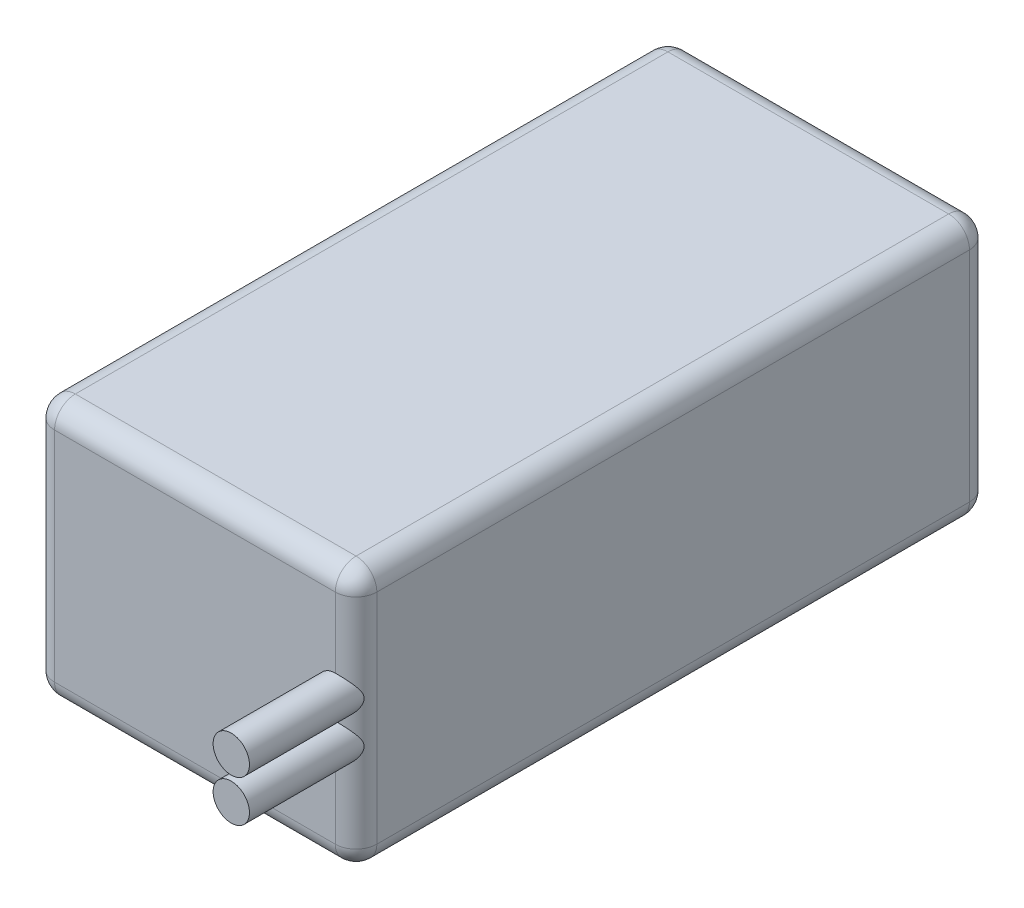
ISO-10303-21;
HEADER;
FILE_DESCRIPTION(('STEP AP214'),'2;1');
FILE_NAME('part.step','',(''),(''),'','','');
FILE_SCHEMA(('AUTOMOTIVE_DESIGN { 1 0 10303 214 1 1 1 1 }'));
ENDSEC;
DATA;
#1=APPLICATION_CONTEXT('core data for automotive mechanical design processes');
#2=APPLICATION_PROTOCOL_DEFINITION('international standard','automotive_design',2000,#1);
#3=PRODUCT_CONTEXT('',#1,'mechanical');
#4=PRODUCT('Part','Part','',(#3));
#5=PRODUCT_RELATED_PRODUCT_CATEGORY('part','',(#4));
#6=PRODUCT_DEFINITION_FORMATION('','',#4);
#7=PRODUCT_DEFINITION_CONTEXT('part definition',#1,'design');
#8=PRODUCT_DEFINITION('design','',#6,#7);
#9=PRODUCT_DEFINITION_SHAPE('','',#8);
#10=(LENGTH_UNIT() NAMED_UNIT(*) SI_UNIT(.MILLI.,.METRE.));
#11=(NAMED_UNIT(*) PLANE_ANGLE_UNIT() SI_UNIT($,.RADIAN.));
#12=(NAMED_UNIT(*) SI_UNIT($,.STERADIAN.) SOLID_ANGLE_UNIT());
#13=UNCERTAINTY_MEASURE_WITH_UNIT(LENGTH_MEASURE(1.E-05),#10,'distance_accuracy_value','');
#14=(GEOMETRIC_REPRESENTATION_CONTEXT(3) GLOBAL_UNCERTAINTY_ASSIGNED_CONTEXT((#13)) GLOBAL_UNIT_ASSIGNED_CONTEXT((#10,
#11,#12)) REPRESENTATION_CONTEXT('',''));
#15=CARTESIAN_POINT('',(0.,0.,0.));
#16=DIRECTION('',(0.,0.,1.));
#17=DIRECTION('',(1.,0.,0.));
#18=AXIS2_PLACEMENT_3D('',#15,#16,#17);
#19=CARTESIAN_POINT('',(15.5,25.,-30.5));
#20=DIRECTION('',(-1.,0.,0.));
#21=DIRECTION('',(0.,0.,1.));
#22=AXIS2_PLACEMENT_3D('',#19,#20,#21);
#23=PLANE('',#22);
#24=DIRECTION('',(0.,-1.,0.));
#25=VECTOR('',#24,1.);
#26=CARTESIAN_POINT('',(15.5,25.,28.5));
#27=LINE('',#26,#25);
#28=CARTESIAN_POINT('',(15.5,23.,28.5));
#29=VERTEX_POINT('',#28);
#30=CARTESIAN_POINT('',(15.5,2.,28.5));
#31=VERTEX_POINT('',#30);
#32=EDGE_CURVE('E327',#29,#31,#27,.T.);
#33=ORIENTED_EDGE('',*,*,#32,.T.);
#34=DIRECTION('',(0.,0.,-1.));
#35=VECTOR('',#34,1.);
#36=CARTESIAN_POINT('',(15.5,2.,-30.5));
#37=LINE('',#36,#35);
#38=CARTESIAN_POINT('',(15.5,2.,-28.5));
#39=VERTEX_POINT('',#38);
#40=EDGE_CURVE('E331',#31,#39,#37,.T.);
#41=ORIENTED_EDGE('',*,*,#40,.T.);
#42=DIRECTION('',(0.,-1.,0.));
#43=VECTOR('',#42,1.);
#44=CARTESIAN_POINT('',(15.5,25.,-28.5));
#45=LINE('',#44,#43);
#46=CARTESIAN_POINT('',(15.5,23.,-28.5));
#47=VERTEX_POINT('',#46);
#48=EDGE_CURVE('E324',#39,#47,#45,.F.);
#49=ORIENTED_EDGE('',*,*,#48,.T.);
#50=DIRECTION('',(0.,0.,-1.));
#51=VECTOR('',#50,1.);
#52=CARTESIAN_POINT('',(15.5,23.,30.5));
#53=LINE('',#52,#51);
#54=EDGE_CURVE('E321',#47,#29,#53,.F.);
#55=ORIENTED_EDGE('',*,*,#54,.T.);
#56=EDGE_LOOP('',(#33,#41,#49,#55));
#57=FACE_BOUND('',#56,.T.);
#58=ADVANCED_FACE('F45',(#57),#23,.F.);
#59=CARTESIAN_POINT('',(-15.5,25.,-30.5));
#60=DIRECTION('',(0.,0.,1.));
#61=DIRECTION('',(1.,0.,0.));
#62=AXIS2_PLACEMENT_3D('',#59,#60,#61);
#63=PLANE('',#62);
#64=DIRECTION('',(0.,-1.,0.));
#65=VECTOR('',#64,1.);
#66=CARTESIAN_POINT('',(13.5,25.,-30.5));
#67=LINE('',#66,#65);
#68=CARTESIAN_POINT('',(13.5,23.,-30.5));
#69=VERTEX_POINT('',#68);
#70=CARTESIAN_POINT('',(13.5,2.,-30.5));
#71=VERTEX_POINT('',#70);
#72=EDGE_CURVE('E161',#69,#71,#67,.T.);
#73=ORIENTED_EDGE('',*,*,#72,.T.);
#74=DIRECTION('',(-1.,0.,0.));
#75=VECTOR('',#74,1.);
#76=CARTESIAN_POINT('',(-15.5,2.,-30.5));
#77=LINE('',#76,#75);
#78=CARTESIAN_POINT('',(-13.5,2.,-30.5));
#79=VERTEX_POINT('',#78);
#80=EDGE_CURVE('E156',#71,#79,#77,.T.);
#81=ORIENTED_EDGE('',*,*,#80,.T.);
#82=DIRECTION('',(0.,-1.,0.));
#83=VECTOR('',#82,1.);
#84=CARTESIAN_POINT('',(-13.5,25.,-30.5));
#85=LINE('',#84,#83);
#86=CARTESIAN_POINT('',(-13.5,23.,-30.5));
#87=VERTEX_POINT('',#86);
#88=EDGE_CURVE('E150',#79,#87,#85,.F.);
#89=ORIENTED_EDGE('',*,*,#88,.T.);
#90=DIRECTION('',(-1.,0.,0.));
#91=VECTOR('',#90,1.);
#92=CARTESIAN_POINT('',(15.5,23.,-30.5));
#93=LINE('',#92,#91);
#94=EDGE_CURVE('E153',#87,#69,#93,.F.);
#95=ORIENTED_EDGE('',*,*,#94,.T.);
#96=EDGE_LOOP('',(#73,#81,#89,#95));
#97=FACE_BOUND('',#96,.T.);
#98=ADVANCED_FACE('F152',(#97),#63,.F.);
#99=CARTESIAN_POINT('',(-15.5,25.,-30.5));
#100=DIRECTION('',(1.,0.,0.));
#101=DIRECTION('',(0.,0.,-1.));
#102=AXIS2_PLACEMENT_3D('',#99,#100,#101);
#103=PLANE('',#102);
#104=DIRECTION('',(0.,-1.,0.));
#105=VECTOR('',#104,1.);
#106=CARTESIAN_POINT('',(-15.5,25.,-28.5));
#107=LINE('',#106,#105);
#108=CARTESIAN_POINT('',(-15.5,23.,-28.5));
#109=VERTEX_POINT('',#108);
#110=CARTESIAN_POINT('',(-15.5,2.,-28.5));
#111=VERTEX_POINT('',#110);
#112=EDGE_CURVE('E186',#109,#111,#107,.T.);
#113=ORIENTED_EDGE('',*,*,#112,.T.);
#114=DIRECTION('',(0.,0.,1.));
#115=VECTOR('',#114,1.);
#116=CARTESIAN_POINT('',(-15.5,2.,-30.5));
#117=LINE('',#116,#115);
#118=CARTESIAN_POINT('',(-15.5,2.,28.5));
#119=VERTEX_POINT('',#118);
#120=EDGE_CURVE('E318',#111,#119,#117,.T.);
#121=ORIENTED_EDGE('',*,*,#120,.T.);
#122=DIRECTION('',(0.,-1.,0.));
#123=VECTOR('',#122,1.);
#124=CARTESIAN_POINT('',(-15.5,25.,28.5));
#125=LINE('',#124,#123);
#126=CARTESIAN_POINT('',(-15.5,23.,28.5));
#127=VERTEX_POINT('',#126);
#128=EDGE_CURVE('E313',#119,#127,#125,.F.);
#129=ORIENTED_EDGE('',*,*,#128,.T.);
#130=DIRECTION('',(0.,0.,1.));
#131=VECTOR('',#130,1.);
#132=CARTESIAN_POINT('',(-15.5,23.,-30.5));
#133=LINE('',#132,#131);
#134=EDGE_CURVE('E310',#127,#109,#133,.F.);
#135=ORIENTED_EDGE('',*,*,#134,.T.);
#136=EDGE_LOOP('',(#113,#121,#129,#135));
#137=FACE_BOUND('',#136,.T.);
#138=ADVANCED_FACE('F386',(#137),#103,.F.);
#139=CARTESIAN_POINT('',(-15.5,25.,30.5));
#140=DIRECTION('',(0.,0.,-1.));
#141=DIRECTION('',(-1.,0.,0.));
#142=AXIS2_PLACEMENT_3D('',#139,#140,#141);
#143=PLANE('',#142);
#144=CARTESIAN_POINT('',(13.5,10.5,30.5));
#145=DIRECTION('',(0.,0.,1.));
#146=DIRECTION('',(1.,0.,0.));
#147=AXIS2_PLACEMENT_3D('',#144,#145,#146);
#148=CIRCLE('',#147,1.75);
#149=CARTESIAN_POINT('',(13.5,8.75,30.5));
#150=VERTEX_POINT('',#149);
#151=CARTESIAN_POINT('',(13.5,12.25,30.5));
#152=VERTEX_POINT('',#151);
#153=EDGE_CURVE('E251',#150,#152,#148,.F.);
#154=ORIENTED_EDGE('',*,*,#153,.T.);
#155=DIRECTION('',(0.,-1.,0.));
#156=VECTOR('',#155,1.);
#157=CARTESIAN_POINT('',(13.5,25.,30.5));
#158=LINE('',#157,#156);
#159=CARTESIAN_POINT('',(13.5,12.75,30.5));
#160=VERTEX_POINT('',#159);
#161=EDGE_CURVE('E307',#152,#160,#158,.F.);
#162=ORIENTED_EDGE('',*,*,#161,.T.);
#163=CARTESIAN_POINT('',(13.5,14.5,30.5));
#164=DIRECTION('',(0.,0.,-1.));
#165=DIRECTION('',(-1.,0.,0.));
#166=AXIS2_PLACEMENT_3D('',#163,#164,#165);
#167=CIRCLE('',#166,1.75);
#168=CARTESIAN_POINT('',(13.5,16.25,30.5));
#169=VERTEX_POINT('',#168);
#170=EDGE_CURVE('E173',#169,#160,#167,.F.);
#171=ORIENTED_EDGE('',*,*,#170,.F.);
#172=DIRECTION('',(0.,-1.,0.));
#173=VECTOR('',#172,1.);
#174=CARTESIAN_POINT('',(13.5,25.,30.5));
#175=LINE('',#174,#173);
#176=CARTESIAN_POINT('',(13.5,23.,30.5));
#177=VERTEX_POINT('',#176);
#178=EDGE_CURVE('E294',#169,#177,#175,.F.);
#179=ORIENTED_EDGE('',*,*,#178,.T.);
#180=DIRECTION('',(1.,0.,0.));
#181=VECTOR('',#180,1.);
#182=CARTESIAN_POINT('',(-15.5,23.,30.5));
#183=LINE('',#182,#181);
#184=CARTESIAN_POINT('',(-13.5,23.,30.5));
#185=VERTEX_POINT('',#184);
#186=EDGE_CURVE('E291',#177,#185,#183,.F.);
#187=ORIENTED_EDGE('',*,*,#186,.T.);
#188=DIRECTION('',(0.,-1.,0.));
#189=VECTOR('',#188,1.);
#190=CARTESIAN_POINT('',(-13.5,25.,30.5));
#191=LINE('',#190,#189);
#192=CARTESIAN_POINT('',(-13.5,2.,30.5));
#193=VERTEX_POINT('',#192);
#194=EDGE_CURVE('E297',#185,#193,#191,.T.);
#195=ORIENTED_EDGE('',*,*,#194,.T.);
#196=DIRECTION('',(1.,0.,0.));
#197=VECTOR('',#196,1.);
#198=CARTESIAN_POINT('',(-15.5,2.,30.5));
#199=LINE('',#198,#197);
#200=CARTESIAN_POINT('',(13.5,2.,30.5));
#201=VERTEX_POINT('',#200);
#202=EDGE_CURVE('E300',#193,#201,#199,.T.);
#203=ORIENTED_EDGE('',*,*,#202,.T.);
#204=DIRECTION('',(0.,-1.,0.));
#205=VECTOR('',#204,1.);
#206=CARTESIAN_POINT('',(13.5,25.,30.5));
#207=LINE('',#206,#205);
#208=EDGE_CURVE('E304',#201,#150,#207,.F.);
#209=ORIENTED_EDGE('',*,*,#208,.T.);
#210=EDGE_LOOP('',(#154,#162,#171,#179,#187,#195,#203,#209));
#211=FACE_BOUND('',#210,.T.);
#212=ADVANCED_FACE('F380',(#211),#143,.F.);
#213=CARTESIAN_POINT('',(0.,25.,0.));
#214=DIRECTION('',(0.,1.,0.));
#215=DIRECTION('',(0.,0.,1.));
#216=AXIS2_PLACEMENT_3D('',#213,#214,#215);
#217=PLANE('',#216);
#218=DIRECTION('',(0.,0.,1.));
#219=VECTOR('',#218,1.);
#220=CARTESIAN_POINT('',(-13.5,25.,30.5));
#221=LINE('',#220,#219);
#222=CARTESIAN_POINT('',(-13.5,25.,-28.5));
#223=VERTEX_POINT('',#222);
#224=CARTESIAN_POINT('',(-13.5,25.,28.5));
#225=VERTEX_POINT('',#224);
#226=EDGE_CURVE('E63',#223,#225,#221,.T.);
#227=ORIENTED_EDGE('',*,*,#226,.T.);
#228=DIRECTION('',(1.,0.,0.));
#229=VECTOR('',#228,1.);
#230=CARTESIAN_POINT('',(15.5,25.,28.5));
#231=LINE('',#230,#229);
#232=CARTESIAN_POINT('',(13.5,25.,28.5));
#233=VERTEX_POINT('',#232);
#234=EDGE_CURVE('E341',#225,#233,#231,.T.);
#235=ORIENTED_EDGE('',*,*,#234,.T.);
#236=DIRECTION('',(0.,0.,-1.));
#237=VECTOR('',#236,1.);
#238=CARTESIAN_POINT('',(13.5,25.,-30.5));
#239=LINE('',#238,#237);
#240=CARTESIAN_POINT('',(13.5,25.,-28.5));
#241=VERTEX_POINT('',#240);
#242=EDGE_CURVE('E334',#233,#241,#239,.T.);
#243=ORIENTED_EDGE('',*,*,#242,.T.);
#244=DIRECTION('',(-1.,0.,0.));
#245=VECTOR('',#244,1.);
#246=CARTESIAN_POINT('',(-15.5,25.,-28.5));
#247=LINE('',#246,#245);
#248=EDGE_CURVE('E68',#241,#223,#247,.T.);
#249=ORIENTED_EDGE('',*,*,#248,.T.);
#250=EDGE_LOOP('',(#227,#235,#243,#249));
#251=FACE_BOUND('',#250,.T.);
#252=ADVANCED_FACE('F377',(#251),#217,.T.);
#253=CARTESIAN_POINT('',(0.,0.,0.));
#254=DIRECTION('',(0.,1.,0.));
#255=DIRECTION('',(0.,0.,1.));
#256=AXIS2_PLACEMENT_3D('',#253,#254,#255);
#257=PLANE('',#256);
#258=DIRECTION('',(1.,0.,0.));
#259=VECTOR('',#258,1.);
#260=CARTESIAN_POINT('',(0.,0.,28.5));
#261=LINE('',#260,#259);
#262=CARTESIAN_POINT('',(13.5,0.,28.5));
#263=VERTEX_POINT('',#262);
#264=CARTESIAN_POINT('',(-13.5,0.,28.5));
#265=VERTEX_POINT('',#264);
#266=EDGE_CURVE('E281',#263,#265,#261,.F.);
#267=ORIENTED_EDGE('',*,*,#266,.T.);
#268=DIRECTION('',(0.,0.,1.));
#269=VECTOR('',#268,1.);
#270=CARTESIAN_POINT('',(-13.5,0.,0.));
#271=LINE('',#270,#269);
#272=CARTESIAN_POINT('',(-13.5,0.,-28.5));
#273=VERTEX_POINT('',#272);
#274=EDGE_CURVE('E288',#265,#273,#271,.F.);
#275=ORIENTED_EDGE('',*,*,#274,.T.);
#276=DIRECTION('',(-1.,0.,0.));
#277=VECTOR('',#276,1.);
#278=CARTESIAN_POINT('',(0.,0.,-28.5));
#279=LINE('',#278,#277);
#280=CARTESIAN_POINT('',(13.5,0.,-28.5));
#281=VERTEX_POINT('',#280);
#282=EDGE_CURVE('E284',#273,#281,#279,.F.);
#283=ORIENTED_EDGE('',*,*,#282,.T.);
#284=DIRECTION('',(0.,0.,-1.));
#285=VECTOR('',#284,1.);
#286=CARTESIAN_POINT('',(13.5,0.,0.));
#287=LINE('',#286,#285);
#288=EDGE_CURVE('E278',#281,#263,#287,.F.);
#289=ORIENTED_EDGE('',*,*,#288,.T.);
#290=EDGE_LOOP('',(#267,#275,#283,#289));
#291=FACE_BOUND('',#290,.T.);
#292=ADVANCED_FACE('F375',(#291),#257,.F.);
#293=CARTESIAN_POINT('',(13.5,14.5,40.5));
#294=DIRECTION('',(0.,0.,-1.));
#295=DIRECTION('',(-1.,0.,0.));
#296=AXIS2_PLACEMENT_3D('',#293,#294,#295);
#297=CYLINDRICAL_SURFACE('',#296,1.75);
#298=CARTESIAN_POINT('',(13.5,14.5,40.5));
#299=DIRECTION('',(0.,0.,1.));
#300=DIRECTION('',(1.,0.,0.));
#301=AXIS2_PLACEMENT_3D('',#298,#299,#300);
#302=CIRCLE('',#301,1.75);
#303=CARTESIAN_POINT('',(15.25,14.5,40.5));
#304=VERTEX_POINT('',#303);
#305=EDGE_CURVE('E265',#304,#304,#302,.T.);
#306=ORIENTED_EDGE('',*,*,#305,.F.);
#307=EDGE_LOOP('',(#306));
#308=FACE_BOUND('',#307,.T.);
#309=ORIENTED_EDGE('',*,*,#170,.T.);
#310=CARTESIAN_POINT('',(13.5,12.75,30.5));
#311=CARTESIAN_POINT('',(13.5411522397854,12.7499904077708,30.500009930612));
#312=CARTESIAN_POINT('',(13.5822970630514,12.751451245837,30.4987301955107));
#313=CARTESIAN_POINT('',(13.6642003605769,12.7572396824727,30.4936674595874));
#314=CARTESIAN_POINT('',(13.7049590943024,12.7615651931795,30.489886281897));
#315=CARTESIAN_POINT('',(13.785458186531,12.7729635595765,30.4799362530637));
#316=CARTESIAN_POINT('',(13.8252040665578,12.7800142891205,30.4737866327881));
#317=CARTESIAN_POINT('',(13.9037148501048,12.7967303576247,30.4592372946331));
#318=CARTESIAN_POINT('',(13.9424796232703,12.8063960420473,30.4508372794548));
#319=CARTESIAN_POINT('',(14.0567092669147,12.8390308068149,30.4225500376096));
#320=CARTESIAN_POINT('',(14.1303963455098,12.8656797563127,30.3995384525789));
#321=CARTESIAN_POINT('',(14.2715913543767,12.9273854763322,30.3467170927728));
#322=CARTESIAN_POINT('',(14.3390863867417,12.9624592697037,30.3168935601603));
#323=CARTESIAN_POINT('',(14.491943648234,13.0545623368453,30.2395214356715));
#324=CARTESIAN_POINT('',(14.5741410463489,13.1148398108444,30.1895753444384));
#325=CARTESIAN_POINT('',(14.7249740673605,13.2462077646548,30.0836600395031));
#326=CARTESIAN_POINT('',(14.793576257381,13.3173241584072,30.0276764876888));
#327=CARTESIAN_POINT('',(14.918728383228,13.4705707905191,29.9122903299628));
#328=CARTESIAN_POINT('',(14.9749819732812,13.5529078610557,29.8528397292722));
#329=CARTESIAN_POINT('',(15.0487625304943,13.6837127938166,29.7660128456874));
#330=CARTESIAN_POINT('',(15.0715794658976,13.7285035129325,29.7374775796423));
#331=CARTESIAN_POINT('',(15.113600352381,13.8207623530626,29.6821565965155));
#332=CARTESIAN_POINT('',(15.1328070510107,13.8682284019771,29.6553695591731));
#333=CARTESIAN_POINT('',(15.1679058744409,13.9675995033164,29.6041204151578));
#334=CARTESIAN_POINT('',(15.1836824610489,14.019594580482,29.5797511222683));
#335=CARTESIAN_POINT('',(15.210663530163,14.1269329049439,29.5364755398292));
#336=CARTESIAN_POINT('',(15.2218767843756,14.1822694916299,29.5175587899443));
#337=CARTESIAN_POINT('',(15.237692467212,14.2872011662924,29.4902722680777));
#338=CARTESIAN_POINT('',(15.243048295828,14.3363635336648,29.4807249979585));
#339=CARTESIAN_POINT('',(15.2495292388131,14.4358159376579,29.4691217005586));
#340=CARTESIAN_POINT('',(15.2506610315262,14.4861040676441,29.4670538482243));
#341=CARTESIAN_POINT('',(15.2485903575146,14.5862818194157,29.4707902414696));
#342=CARTESIAN_POINT('',(15.245387614776,14.6361714156198,29.4765949883591));
#343=CARTESIAN_POINT('',(15.2349536407351,14.7342672228474,29.4950096195382));
#344=CARTESIAN_POINT('',(15.2277143465895,14.7824698587834,29.5076331224265));
#345=CARTESIAN_POINT('',(15.2042505591075,14.9048866504777,29.5470485417914));
#346=CARTESIAN_POINT('',(15.1852402420775,14.9772561736244,29.5777939046892));
#347=CARTESIAN_POINT('',(15.1395636190221,15.1162151497358,29.6460944398059));
#348=CARTESIAN_POINT('',(15.112865343058,15.1827789218411,29.6836778020766));
#349=CARTESIAN_POINT('',(15.0583995753075,15.298192980149,29.7541835766998));
#350=CARTESIAN_POINT('',(15.0318655693204,15.3479592452243,29.7865772355753));
#351=CARTESIAN_POINT('',(14.974378715549,15.4443842784062,29.8520768369737));
#352=CARTESIAN_POINT('',(14.9434233904729,15.4910412827353,29.8851831699204));
#353=CARTESIAN_POINT('',(14.8440064955768,15.6263544232357,29.9840291241305));
#354=CARTESIAN_POINT('',(14.7688910093535,15.7105695889101,30.0494375905079));
#355=CARTESIAN_POINT('',(14.6198919412521,15.8476327192848,30.1590289949576));
#356=CARTESIAN_POINT('',(14.5496068539728,15.9032599427515,30.2046577572928));
#357=CARTESIAN_POINT('',(14.3984188285331,16.0045220351814,30.2889358162188));
#358=CARTESIAN_POINT('',(14.3175330388122,16.0501727313557,30.3275961505076));
#359=CARTESIAN_POINT('',(14.1622722453693,16.1216548061291,30.3886482558801));
#360=CARTESIAN_POINT('',(14.0895393986095,16.1495995501929,30.4127326349953));
#361=CARTESIAN_POINT('',(13.9389935146128,16.1958630721182,30.4527712344551));
#362=CARTESIAN_POINT('',(13.8611907519329,16.2142006768662,30.4687413542551));
#363=CARTESIAN_POINT('',(13.7356369559444,16.2346986685894,30.486621915598));
#364=CARTESIAN_POINT('',(13.6888690833132,16.2404158811264,30.4916179075462));
#365=CARTESIAN_POINT('',(13.5947454697159,16.24807416547,30.4983147747787));
#366=CARTESIAN_POINT('',(13.5473891829054,16.2500114190375,30.5000123182035));
#367=CARTESIAN_POINT('',(13.5,16.25,30.5));
#368=B_SPLINE_CURVE_WITH_KNOTS('',3,(#310,#311,#312,#313,#314,#315,#316,#317,#318,#319,#320,
#321,#322,#323,#324,#325,#326,#327,#328,#329,#330,#331,#332,#333,#334,#335,#336,#337,#338,#339,
#340,#341,#342,#343,#344,#345,#346,#347,#348,#349,#350,#351,#352,#353,#354,#355,#356,#357,#358,
#359,#360,#361,#362,#363,#364,#365,#366,#367),.UNSPECIFIED.,.F.,.F.,(4,2,2,2,2,2,2,2,2,2,2,2,2,
2,2,2,2,2,2,2,2,2,2,2,2,2,2,2,4),(0.,0.123398821738528,0.246707805396895,0.369035984759896,
0.491380332834454,0.735203576327151,0.979523684453023,1.31818758696589,1.65767425828235,
2.00458439256526,2.17784296252892,2.35096913641874,2.52924311409649,2.70717277356575,
2.85762979262983,3.00784883302153,3.15807743948173,3.30860720187432,3.54991890707361,
3.79224895438335,3.9871184901925,4.18209764405763,4.57122860570283,4.87193796806002,
5.17216675155272,5.41586020613622,5.65907429695901,5.80096813174913,5.94300522329899),.UNSPECIFIED.);
#369=EDGE_CURVE('E11',#160,#169,#368,.T.);
#370=ORIENTED_EDGE('',*,*,#369,.T.);
#371=EDGE_LOOP('',(#309,#370));
#372=FACE_BOUND('',#371,.T.);
#373=ADVANCED_FACE('F370',(#308,#372),#297,.T.);
#374=CARTESIAN_POINT('',(0.,0.,40.5));
#375=DIRECTION('',(0.,0.,1.));
#376=DIRECTION('',(1.,0.,0.));
#377=AXIS2_PLACEMENT_3D('',#374,#375,#376);
#378=PLANE('',#377);
#379=ORIENTED_EDGE('',*,*,#305,.T.);
#380=EDGE_LOOP('',(#379));
#381=FACE_BOUND('',#380,.T.);
#382=ADVANCED_FACE('F367',(#381),#378,.T.);
#383=CARTESIAN_POINT('',(13.5,10.5,40.5));
#384=DIRECTION('',(0.,0.,-1.));
#385=DIRECTION('',(-1.,0.,0.));
#386=AXIS2_PLACEMENT_3D('',#383,#384,#385);
#387=CYLINDRICAL_SURFACE('',#386,1.75);
#388=CARTESIAN_POINT('',(13.5,10.5,40.5));
#389=DIRECTION('',(0.,0.,1.));
#390=DIRECTION('',(1.,0.,0.));
#391=AXIS2_PLACEMENT_3D('',#388,#389,#390);
#392=CIRCLE('',#391,1.75);
#393=CARTESIAN_POINT('',(15.25,10.5,40.5));
#394=VERTEX_POINT('',#393);
#395=EDGE_CURVE('E258',#394,#394,#392,.F.);
#396=ORIENTED_EDGE('',*,*,#395,.T.);
#397=EDGE_LOOP('',(#396));
#398=FACE_BOUND('',#397,.T.);
#399=ORIENTED_EDGE('',*,*,#153,.F.);
#400=CARTESIAN_POINT('',(13.5,8.75,30.5));
#401=CARTESIAN_POINT('',(13.5411522397854,8.7499904077708,30.500009930612));
#402=CARTESIAN_POINT('',(13.5822970630514,8.75145124583701,30.4987301955107));
#403=CARTESIAN_POINT('',(13.6642003605769,8.75723968247273,30.4936674595874));
#404=CARTESIAN_POINT('',(13.7049590943024,8.76156519317949,30.489886281897));
#405=CARTESIAN_POINT('',(13.785458186531,8.7729635595765,30.4799362530637));
#406=CARTESIAN_POINT('',(13.8252040665578,8.78001428912055,30.4737866327881));
#407=CARTESIAN_POINT('',(13.9037148501048,8.7967303576247,30.4592372946331));
#408=CARTESIAN_POINT('',(13.9424796232703,8.80639604204729,30.4508372794548));
#409=CARTESIAN_POINT('',(14.0567092669147,8.83903080681486,30.4225500376096));
#410=CARTESIAN_POINT('',(14.1303963455098,8.86567975631271,30.3995384525789));
#411=CARTESIAN_POINT('',(14.2715913543767,8.92738547633218,30.3467170927728));
#412=CARTESIAN_POINT('',(14.3390863867417,8.96245926970369,30.3168935601603));
#413=CARTESIAN_POINT('',(14.491943648234,9.05456233684528,30.2395214356715));
#414=CARTESIAN_POINT('',(14.5741410463489,9.11483981084444,30.1895753444384));
#415=CARTESIAN_POINT('',(14.7249740673605,9.24620776465484,30.0836600395031));
#416=CARTESIAN_POINT('',(14.793576257381,9.31732415840718,30.0276764876888));
#417=CARTESIAN_POINT('',(14.918728383228,9.47057079051913,29.9122903299628));
#418=CARTESIAN_POINT('',(14.9749819732812,9.55290786105574,29.8528397292722));
#419=CARTESIAN_POINT('',(15.0487625304943,9.68371279381664,29.7660128456874));
#420=CARTESIAN_POINT('',(15.0715794658976,9.72850351293254,29.7374775796423));
#421=CARTESIAN_POINT('',(15.113600352381,9.82076235306258,29.6821565965155));
#422=CARTESIAN_POINT('',(15.1328070510107,9.86822840197709,29.6553695591731));
#423=CARTESIAN_POINT('',(15.1679058744409,9.96759950331645,29.6041204151578));
#424=CARTESIAN_POINT('',(15.1836824610489,10.019594580482,29.5797511222683));
#425=CARTESIAN_POINT('',(15.210663530163,10.1269329049439,29.5364755398292));
#426=CARTESIAN_POINT('',(15.2218767843756,10.1822694916299,29.5175587899443));
#427=CARTESIAN_POINT('',(15.237692467212,10.2872011662924,29.4902722680777));
#428=CARTESIAN_POINT('',(15.243048295828,10.3363635336648,29.4807249979585));
#429=CARTESIAN_POINT('',(15.2495292388131,10.4358159376579,29.4691217005586));
#430=CARTESIAN_POINT('',(15.2506610315262,10.4861040676441,29.4670538482243));
#431=CARTESIAN_POINT('',(15.2485903575146,10.5862818194157,29.4707902414696));
#432=CARTESIAN_POINT('',(15.245387614776,10.6361714156198,29.4765949883591));
#433=CARTESIAN_POINT('',(15.2349536407351,10.7342672228474,29.4950096195382));
#434=CARTESIAN_POINT('',(15.2277143465895,10.7824698587834,29.5076331224265));
#435=CARTESIAN_POINT('',(15.2042505591075,10.9048866504777,29.5470485417914));
#436=CARTESIAN_POINT('',(15.1852402420775,10.9772561736244,29.5777939046892));
#437=CARTESIAN_POINT('',(15.1395636190221,11.1162151497358,29.6460944398059));
#438=CARTESIAN_POINT('',(15.112865343058,11.1827789218411,29.6836778020766));
#439=CARTESIAN_POINT('',(15.0583995753075,11.298192980149,29.7541835766998));
#440=CARTESIAN_POINT('',(15.0318655693204,11.3479592452243,29.7865772355753));
#441=CARTESIAN_POINT('',(14.974378715549,11.4443842784062,29.8520768369737));
#442=CARTESIAN_POINT('',(14.9434233904729,11.4910412827353,29.8851831699204));
#443=CARTESIAN_POINT('',(14.8440064955768,11.6263544232357,29.9840291241305));
#444=CARTESIAN_POINT('',(14.7688910093535,11.7105695889101,30.0494375905079));
#445=CARTESIAN_POINT('',(14.6198919412521,11.8476327192848,30.1590289949576));
#446=CARTESIAN_POINT('',(14.5496068539728,11.9032599427515,30.2046577572928));
#447=CARTESIAN_POINT('',(14.3984188285331,12.0045220351814,30.2889358162188));
#448=CARTESIAN_POINT('',(14.3175330388122,12.0501727313558,30.3275961505076));
#449=CARTESIAN_POINT('',(14.1622722453693,12.1216548061291,30.3886482558801));
#450=CARTESIAN_POINT('',(14.0895393986095,12.1495995501929,30.4127326349953));
#451=CARTESIAN_POINT('',(13.9389935146127,12.1958630721182,30.4527712344551));
#452=CARTESIAN_POINT('',(13.8611907519329,12.2142006768662,30.4687413542551));
#453=CARTESIAN_POINT('',(13.7356369559444,12.2346986685894,30.486621915598));
#454=CARTESIAN_POINT('',(13.6888690833132,12.2404158811264,30.4916179075462));
#455=CARTESIAN_POINT('',(13.5947454697159,12.24807416547,30.4983147747787));
#456=CARTESIAN_POINT('',(13.5473891829054,12.2500114190375,30.5000123182035));
#457=CARTESIAN_POINT('',(13.5,12.25,30.5));
#458=B_SPLINE_CURVE_WITH_KNOTS('',3,(#400,#401,#402,#403,#404,#405,#406,#407,#408,#409,#410,
#411,#412,#413,#414,#415,#416,#417,#418,#419,#420,#421,#422,#423,#424,#425,#426,#427,#428,#429,
#430,#431,#432,#433,#434,#435,#436,#437,#438,#439,#440,#441,#442,#443,#444,#445,#446,#447,#448,
#449,#450,#451,#452,#453,#454,#455,#456,#457),.UNSPECIFIED.,.F.,.F.,(4,2,2,2,2,2,2,2,2,2,2,2,2,
2,2,2,2,2,2,2,2,2,2,2,2,2,2,2,4),(0.,0.123398821738528,0.246707805396895,0.369035984759896,
0.491380332834454,0.735203576327151,0.979523684453023,1.31818758696589,1.65767425828235,
2.00458439256526,2.17784296252892,2.35096913641874,2.52924311409649,2.70717277356575,
2.85762979262983,3.00784883302153,3.15807743948173,3.30860720187432,3.54991890707361,
3.79224895438335,3.98711849019249,4.18209764405763,4.57122860570284,4.87193796806003,
5.17216675155273,5.41586020613622,5.65907429695902,5.80096813174913,5.94300522329899),.UNSPECIFIED.);
#459=EDGE_CURVE('E55',#150,#152,#458,.T.);
#460=ORIENTED_EDGE('',*,*,#459,.T.);
#461=EDGE_LOOP('',(#399,#460));
#462=FACE_BOUND('',#461,.T.);
#463=ADVANCED_FACE('F361',(#398,#462),#387,.T.);
#464=CARTESIAN_POINT('',(0.,0.,40.5));
#465=DIRECTION('',(0.,0.,1.));
#466=DIRECTION('',(1.,0.,0.));
#467=AXIS2_PLACEMENT_3D('',#464,#465,#466);
#468=PLANE('',#467);
#469=ORIENTED_EDGE('',*,*,#395,.F.);
#470=EDGE_LOOP('',(#469));
#471=FACE_BOUND('',#470,.T.);
#472=ADVANCED_FACE('F366',(#471),#468,.T.);
#473=CARTESIAN_POINT('',(0.,23.,28.5));
#474=DIRECTION('',(-1.,0.,0.));
#475=DIRECTION('',(0.,0.,1.));
#476=AXIS2_PLACEMENT_3D('',#473,#474,#475);
#477=CYLINDRICAL_SURFACE('',#476,2.);
#478=CARTESIAN_POINT('',(13.5,23.,28.5));
#479=DIRECTION('',(1.,0.,0.));
#480=DIRECTION('',(0.,0.,-1.));
#481=AXIS2_PLACEMENT_3D('',#478,#479,#480);
#482=CIRCLE('',#481,2.);
#483=EDGE_CURVE('E49',#233,#177,#482,.T.);
#484=ORIENTED_EDGE('',*,*,#483,.F.);
#485=ORIENTED_EDGE('',*,*,#234,.F.);
#486=CARTESIAN_POINT('',(-13.5,23.,28.5));
#487=DIRECTION('',(-1.,0.,0.));
#488=DIRECTION('',(0.,0.,1.));
#489=AXIS2_PLACEMENT_3D('',#486,#487,#488);
#490=CIRCLE('',#489,2.);
#491=EDGE_CURVE('E242',#185,#225,#490,.T.);
#492=ORIENTED_EDGE('',*,*,#491,.F.);
#493=ORIENTED_EDGE('',*,*,#186,.F.);
#494=EDGE_LOOP('',(#484,#485,#492,#493));
#495=FACE_BOUND('',#494,.T.);
#496=ADVANCED_FACE('F47',(#495),#477,.T.);
#497=CARTESIAN_POINT('',(13.5,23.,28.5));
#498=DIRECTION('',(0.,0.,1.));
#499=DIRECTION('',(1.,0.,0.));
#500=AXIS2_PLACEMENT_3D('',#497,#498,#499);
#501=SPHERICAL_SURFACE('',#500,2.);
#502=CARTESIAN_POINT('',(13.5,23.,28.5));
#503=DIRECTION('',(0.,0.,1.));
#504=DIRECTION('',(1.,0.,0.));
#505=AXIS2_PLACEMENT_3D('',#502,#503,#504);
#506=CIRCLE('',#505,2.);
#507=EDGE_CURVE('E235',#233,#29,#506,.F.);
#508=ORIENTED_EDGE('',*,*,#507,.F.);
#509=ORIENTED_EDGE('',*,*,#483,.T.);
#510=CARTESIAN_POINT('',(13.5,23.,28.5));
#511=DIRECTION('',(0.,1.,0.));
#512=DIRECTION('',(0.,0.,1.));
#513=AXIS2_PLACEMENT_3D('',#510,#511,#512);
#514=CIRCLE('',#513,2.);
#515=EDGE_CURVE('E239',#29,#177,#514,.F.);
#516=ORIENTED_EDGE('',*,*,#515,.F.);
#517=EDGE_LOOP('',(#508,#509,#516));
#518=FACE_BOUND('',#517,.T.);
#519=ADVANCED_FACE('F459',(#518),#501,.T.);
#520=CARTESIAN_POINT('',(-13.5,23.,28.5));
#521=DIRECTION('',(0.,0.,1.));
#522=DIRECTION('',(1.,0.,0.));
#523=AXIS2_PLACEMENT_3D('',#520,#521,#522);
#524=SPHERICAL_SURFACE('',#523,2.);
#525=CARTESIAN_POINT('',(-13.5,23.,28.5));
#526=DIRECTION('',(0.,1.,0.));
#527=DIRECTION('',(0.,0.,1.));
#528=AXIS2_PLACEMENT_3D('',#525,#526,#527);
#529=CIRCLE('',#528,2.);
#530=EDGE_CURVE('E227',#185,#127,#529,.F.);
#531=ORIENTED_EDGE('',*,*,#530,.F.);
#532=ORIENTED_EDGE('',*,*,#491,.T.);
#533=CARTESIAN_POINT('',(-13.5,23.,28.5));
#534=DIRECTION('',(0.,0.,1.));
#535=DIRECTION('',(1.,0.,0.));
#536=AXIS2_PLACEMENT_3D('',#533,#534,#535);
#537=CIRCLE('',#536,2.);
#538=EDGE_CURVE('E231',#127,#225,#537,.F.);
#539=ORIENTED_EDGE('',*,*,#538,.F.);
#540=EDGE_LOOP('',(#531,#532,#539));
#541=FACE_BOUND('',#540,.T.);
#542=ADVANCED_FACE('F454',(#541),#524,.T.);
#543=CARTESIAN_POINT('',(13.5,25.,28.5));
#544=DIRECTION('',(0.,-1.,0.));
#545=DIRECTION('',(0.,0.,-1.));
#546=AXIS2_PLACEMENT_3D('',#543,#544,#545);
#547=CYLINDRICAL_SURFACE('',#546,2.);
#548=ORIENTED_EDGE('',*,*,#459,.F.);
#549=ORIENTED_EDGE('',*,*,#208,.F.);
#550=CARTESIAN_POINT('',(13.5,2.,28.5));
#551=DIRECTION('',(0.,-1.,0.));
#552=DIRECTION('',(0.,0.,-1.));
#553=AXIS2_PLACEMENT_3D('',#550,#551,#552);
#554=CIRCLE('',#553,2.);
#555=EDGE_CURVE('E220',#31,#201,#554,.T.);
#556=ORIENTED_EDGE('',*,*,#555,.F.);
#557=ORIENTED_EDGE('',*,*,#32,.F.);
#558=ORIENTED_EDGE('',*,*,#515,.T.);
#559=ORIENTED_EDGE('',*,*,#178,.F.);
#560=ORIENTED_EDGE('',*,*,#369,.F.);
#561=ORIENTED_EDGE('',*,*,#161,.F.);
#562=EDGE_LOOP('',(#548,#549,#556,#557,#558,#559,#560,#561));
#563=FACE_BOUND('',#562,.T.);
#564=ADVANCED_FACE('F357',(#563),#547,.T.);
#565=CARTESIAN_POINT('',(13.5,23.,0.));
#566=DIRECTION('',(0.,0.,1.));
#567=DIRECTION('',(1.,0.,0.));
#568=AXIS2_PLACEMENT_3D('',#565,#566,#567);
#569=CYLINDRICAL_SURFACE('',#568,2.);
#570=ORIENTED_EDGE('',*,*,#507,.T.);
#571=ORIENTED_EDGE('',*,*,#54,.F.);
#572=CARTESIAN_POINT('',(13.5,23.,-28.5));
#573=DIRECTION('',(0.,0.,-1.));
#574=DIRECTION('',(-1.,0.,0.));
#575=AXIS2_PLACEMENT_3D('',#572,#573,#574);
#576=CIRCLE('',#575,2.);
#577=EDGE_CURVE('E216',#241,#47,#576,.T.);
#578=ORIENTED_EDGE('',*,*,#577,.F.);
#579=ORIENTED_EDGE('',*,*,#242,.F.);
#580=EDGE_LOOP('',(#570,#571,#578,#579));
#581=FACE_BOUND('',#580,.T.);
#582=ADVANCED_FACE('F448',(#581),#569,.T.);
#583=CARTESIAN_POINT('',(0.,23.,-28.5));
#584=DIRECTION('',(1.,0.,0.));
#585=DIRECTION('',(0.,0.,-1.));
#586=AXIS2_PLACEMENT_3D('',#583,#584,#585);
#587=CYLINDRICAL_SURFACE('',#586,2.);
#588=CARTESIAN_POINT('',(-13.5,23.,-28.5));
#589=DIRECTION('',(-1.,0.,0.));
#590=DIRECTION('',(0.,0.,1.));
#591=AXIS2_PLACEMENT_3D('',#588,#589,#590);
#592=CIRCLE('',#591,2.);
#593=EDGE_CURVE('E167',#223,#87,#592,.T.);
#594=ORIENTED_EDGE('',*,*,#593,.F.);
#595=ORIENTED_EDGE('',*,*,#248,.F.);
#596=CARTESIAN_POINT('',(13.5,23.,-28.5));
#597=DIRECTION('',(1.,0.,0.));
#598=DIRECTION('',(0.,1.,0.));
#599=AXIS2_PLACEMENT_3D('',#596,#597,#598);
#600=CIRCLE('',#599,2.);
#601=EDGE_CURVE('E170',#69,#241,#600,.T.);
#602=ORIENTED_EDGE('',*,*,#601,.F.);
#603=ORIENTED_EDGE('',*,*,#94,.F.);
#604=EDGE_LOOP('',(#594,#595,#602,#603));
#605=FACE_BOUND('',#604,.T.);
#606=ADVANCED_FACE('F166',(#605),#587,.T.);
#607=CARTESIAN_POINT('',(-13.5,23.,0.));
#608=DIRECTION('',(0.,0.,-1.));
#609=DIRECTION('',(-1.,0.,0.));
#610=AXIS2_PLACEMENT_3D('',#607,#608,#609);
#611=CYLINDRICAL_SURFACE('',#610,2.);
#612=ORIENTED_EDGE('',*,*,#538,.T.);
#613=ORIENTED_EDGE('',*,*,#226,.F.);
#614=CARTESIAN_POINT('',(-13.5,23.,-28.5));
#615=DIRECTION('',(0.,0.,-1.));
#616=DIRECTION('',(-1.,0.,0.));
#617=AXIS2_PLACEMENT_3D('',#614,#615,#616);
#618=CIRCLE('',#617,2.);
#619=EDGE_CURVE('E181',#109,#223,#618,.T.);
#620=ORIENTED_EDGE('',*,*,#619,.F.);
#621=ORIENTED_EDGE('',*,*,#134,.F.);
#622=EDGE_LOOP('',(#612,#613,#620,#621));
#623=FACE_BOUND('',#622,.T.);
#624=ADVANCED_FACE('F442',(#623),#611,.T.);
#625=CARTESIAN_POINT('',(-13.5,25.,28.5));
#626=DIRECTION('',(0.,-1.,0.));
#627=DIRECTION('',(0.,0.,-1.));
#628=AXIS2_PLACEMENT_3D('',#625,#626,#627);
#629=CYLINDRICAL_SURFACE('',#628,2.);
#630=ORIENTED_EDGE('',*,*,#530,.T.);
#631=ORIENTED_EDGE('',*,*,#128,.F.);
#632=CARTESIAN_POINT('',(-13.5,2.,28.5));
#633=DIRECTION('',(0.,-1.,0.));
#634=DIRECTION('',(0.,0.,-1.));
#635=AXIS2_PLACEMENT_3D('',#632,#633,#634);
#636=CIRCLE('',#635,2.);
#637=EDGE_CURVE('E208',#193,#119,#636,.T.);
#638=ORIENTED_EDGE('',*,*,#637,.F.);
#639=ORIENTED_EDGE('',*,*,#194,.F.);
#640=EDGE_LOOP('',(#630,#631,#638,#639));
#641=FACE_BOUND('',#640,.T.);
#642=ADVANCED_FACE('F438',(#641),#629,.T.);
#643=CARTESIAN_POINT('',(-15.5,2.,28.5));
#644=DIRECTION('',(1.,0.,0.));
#645=DIRECTION('',(0.,0.,-1.));
#646=AXIS2_PLACEMENT_3D('',#643,#644,#645);
#647=CYLINDRICAL_SURFACE('',#646,2.);
#648=CARTESIAN_POINT('',(13.5,2.,28.5));
#649=DIRECTION('',(1.,0.,0.));
#650=DIRECTION('',(0.,0.,-1.));
#651=AXIS2_PLACEMENT_3D('',#648,#649,#650);
#652=CIRCLE('',#651,2.);
#653=EDGE_CURVE('E223',#201,#263,#652,.T.);
#654=ORIENTED_EDGE('',*,*,#653,.F.);
#655=ORIENTED_EDGE('',*,*,#202,.F.);
#656=CARTESIAN_POINT('',(-13.5,2.,28.5));
#657=DIRECTION('',(-1.,0.,0.));
#658=DIRECTION('',(0.,0.,1.));
#659=AXIS2_PLACEMENT_3D('',#656,#657,#658);
#660=CIRCLE('',#659,2.);
#661=EDGE_CURVE('E204',#265,#193,#660,.T.);
#662=ORIENTED_EDGE('',*,*,#661,.F.);
#663=ORIENTED_EDGE('',*,*,#266,.F.);
#664=EDGE_LOOP('',(#654,#655,#662,#663));
#665=FACE_BOUND('',#664,.T.);
#666=ADVANCED_FACE('F434',(#665),#647,.T.);
#667=CARTESIAN_POINT('',(13.5,2.,28.5));
#668=DIRECTION('',(0.,0.,1.));
#669=DIRECTION('',(1.,0.,0.));
#670=AXIS2_PLACEMENT_3D('',#667,#668,#669);
#671=SPHERICAL_SURFACE('',#670,2.);
#672=ORIENTED_EDGE('',*,*,#555,.T.);
#673=ORIENTED_EDGE('',*,*,#653,.T.);
#674=CARTESIAN_POINT('',(13.5,2.,28.5));
#675=DIRECTION('',(0.,0.,1.));
#676=DIRECTION('',(1.,0.,0.));
#677=AXIS2_PLACEMENT_3D('',#674,#675,#676);
#678=CIRCLE('',#677,2.);
#679=EDGE_CURVE('E194',#31,#263,#678,.F.);
#680=ORIENTED_EDGE('',*,*,#679,.F.);
#681=EDGE_LOOP('',(#672,#673,#680));
#682=FACE_BOUND('',#681,.T.);
#683=ADVANCED_FACE('F430',(#682),#671,.T.);
#684=CARTESIAN_POINT('',(13.5,23.,-28.5));
#685=DIRECTION('',(0.,0.,1.));
#686=DIRECTION('',(1.,0.,0.));
#687=AXIS2_PLACEMENT_3D('',#684,#685,#686);
#688=SPHERICAL_SURFACE('',#687,2.);
#689=ORIENTED_EDGE('',*,*,#601,.T.);
#690=ORIENTED_EDGE('',*,*,#577,.T.);
#691=CARTESIAN_POINT('',(13.5,23.,-28.5));
#692=DIRECTION('',(0.,1.,0.));
#693=DIRECTION('',(0.,0.,1.));
#694=AXIS2_PLACEMENT_3D('',#691,#692,#693);
#695=CIRCLE('',#694,2.);
#696=EDGE_CURVE('E188',#69,#47,#695,.F.);
#697=ORIENTED_EDGE('',*,*,#696,.F.);
#698=EDGE_LOOP('',(#689,#690,#697));
#699=FACE_BOUND('',#698,.T.);
#700=ADVANCED_FACE('F427',(#699),#688,.T.);
#701=CARTESIAN_POINT('',(-13.5,23.,-28.5));
#702=DIRECTION('',(0.,0.,1.));
#703=DIRECTION('',(1.,0.,0.));
#704=AXIS2_PLACEMENT_3D('',#701,#702,#703);
#705=SPHERICAL_SURFACE('',#704,2.);
#706=ORIENTED_EDGE('',*,*,#619,.T.);
#707=ORIENTED_EDGE('',*,*,#593,.T.);
#708=CARTESIAN_POINT('',(-13.5,23.,-28.5));
#709=DIRECTION('',(0.,1.,0.));
#710=DIRECTION('',(0.,0.,1.));
#711=AXIS2_PLACEMENT_3D('',#708,#709,#710);
#712=CIRCLE('',#711,2.);
#713=EDGE_CURVE('E178',#109,#87,#712,.F.);
#714=ORIENTED_EDGE('',*,*,#713,.F.);
#715=EDGE_LOOP('',(#706,#707,#714));
#716=FACE_BOUND('',#715,.T.);
#717=ADVANCED_FACE('F177',(#716),#705,.T.);
#718=CARTESIAN_POINT('',(-13.5,2.,28.5));
#719=DIRECTION('',(0.,0.,1.));
#720=DIRECTION('',(1.,0.,0.));
#721=AXIS2_PLACEMENT_3D('',#718,#719,#720);
#722=SPHERICAL_SURFACE('',#721,2.);
#723=ORIENTED_EDGE('',*,*,#661,.T.);
#724=ORIENTED_EDGE('',*,*,#637,.T.);
#725=CARTESIAN_POINT('',(-13.5,2.,28.5));
#726=DIRECTION('',(0.,0.,1.));
#727=DIRECTION('',(1.,0.,0.));
#728=AXIS2_PLACEMENT_3D('',#725,#726,#727);
#729=CIRCLE('',#728,2.);
#730=EDGE_CURVE('E189',#265,#119,#729,.F.);
#731=ORIENTED_EDGE('',*,*,#730,.F.);
#732=EDGE_LOOP('',(#723,#724,#731));
#733=FACE_BOUND('',#732,.T.);
#734=ADVANCED_FACE('F420',(#733),#722,.T.);
#735=CARTESIAN_POINT('',(13.5,2.,-30.5));
#736=DIRECTION('',(0.,0.,-1.));
#737=DIRECTION('',(-1.,0.,0.));
#738=AXIS2_PLACEMENT_3D('',#735,#736,#737);
#739=CYLINDRICAL_SURFACE('',#738,2.);
#740=ORIENTED_EDGE('',*,*,#679,.T.);
#741=ORIENTED_EDGE('',*,*,#288,.F.);
#742=CARTESIAN_POINT('',(13.5,2.,-28.5));
#743=DIRECTION('',(0.,0.,-1.));
#744=DIRECTION('',(-1.,0.,0.));
#745=AXIS2_PLACEMENT_3D('',#742,#743,#744);
#746=CIRCLE('',#745,2.);
#747=EDGE_CURVE('E197',#39,#281,#746,.T.);
#748=ORIENTED_EDGE('',*,*,#747,.F.);
#749=ORIENTED_EDGE('',*,*,#40,.F.);
#750=EDGE_LOOP('',(#740,#741,#748,#749));
#751=FACE_BOUND('',#750,.T.);
#752=ADVANCED_FACE('F416',(#751),#739,.T.);
#753=CARTESIAN_POINT('',(13.5,25.,-28.5));
#754=DIRECTION('',(0.,-1.,0.));
#755=DIRECTION('',(0.,0.,-1.));
#756=AXIS2_PLACEMENT_3D('',#753,#754,#755);
#757=CYLINDRICAL_SURFACE('',#756,2.);
#758=ORIENTED_EDGE('',*,*,#696,.T.);
#759=ORIENTED_EDGE('',*,*,#48,.F.);
#760=CARTESIAN_POINT('',(13.5,2.,-28.5));
#761=DIRECTION('',(0.,-1.,0.));
#762=DIRECTION('',(0.,0.,-1.));
#763=AXIS2_PLACEMENT_3D('',#760,#761,#762);
#764=CIRCLE('',#763,2.);
#765=EDGE_CURVE('E469',#71,#39,#764,.T.);
#766=ORIENTED_EDGE('',*,*,#765,.F.);
#767=ORIENTED_EDGE('',*,*,#72,.F.);
#768=EDGE_LOOP('',(#758,#759,#766,#767));
#769=FACE_BOUND('',#768,.T.);
#770=ADVANCED_FACE('F413',(#769),#757,.T.);
#771=CARTESIAN_POINT('',(-13.5,25.,-28.5));
#772=DIRECTION('',(0.,-1.,0.));
#773=DIRECTION('',(0.,0.,-1.));
#774=AXIS2_PLACEMENT_3D('',#771,#772,#773);
#775=CYLINDRICAL_SURFACE('',#774,2.);
#776=ORIENTED_EDGE('',*,*,#713,.T.);
#777=ORIENTED_EDGE('',*,*,#88,.F.);
#778=CARTESIAN_POINT('',(-13.5,2.,-28.5));
#779=DIRECTION('',(0.,-1.,0.));
#780=DIRECTION('',(0.,0.,-1.));
#781=AXIS2_PLACEMENT_3D('',#778,#779,#780);
#782=CIRCLE('',#781,2.);
#783=EDGE_CURVE('E477',#111,#79,#782,.T.);
#784=ORIENTED_EDGE('',*,*,#783,.F.);
#785=ORIENTED_EDGE('',*,*,#112,.F.);
#786=EDGE_LOOP('',(#776,#777,#784,#785));
#787=FACE_BOUND('',#786,.T.);
#788=ADVANCED_FACE('F184',(#787),#775,.T.);
#789=CARTESIAN_POINT('',(-13.5,2.,-30.5));
#790=DIRECTION('',(0.,0.,1.));
#791=DIRECTION('',(1.,0.,0.));
#792=AXIS2_PLACEMENT_3D('',#789,#790,#791);
#793=CYLINDRICAL_SURFACE('',#792,2.);
#794=ORIENTED_EDGE('',*,*,#730,.T.);
#795=ORIENTED_EDGE('',*,*,#120,.F.);
#796=CARTESIAN_POINT('',(-13.5,2.,-28.5));
#797=DIRECTION('',(0.,0.,-1.));
#798=DIRECTION('',(-1.,0.,0.));
#799=AXIS2_PLACEMENT_3D('',#796,#797,#798);
#800=CIRCLE('',#799,2.);
#801=EDGE_CURVE('E481',#273,#111,#800,.T.);
#802=ORIENTED_EDGE('',*,*,#801,.F.);
#803=ORIENTED_EDGE('',*,*,#274,.F.);
#804=EDGE_LOOP('',(#794,#795,#802,#803));
#805=FACE_BOUND('',#804,.T.);
#806=ADVANCED_FACE('F406',(#805),#793,.T.);
#807=CARTESIAN_POINT('',(13.5,2.,-28.5));
#808=DIRECTION('',(0.,0.,1.));
#809=DIRECTION('',(1.,0.,0.));
#810=AXIS2_PLACEMENT_3D('',#807,#808,#809);
#811=SPHERICAL_SURFACE('',#810,2.);
#812=ORIENTED_EDGE('',*,*,#765,.T.);
#813=ORIENTED_EDGE('',*,*,#747,.T.);
#814=CARTESIAN_POINT('',(13.5,2.,-28.5));
#815=DIRECTION('',(1.,0.,0.));
#816=DIRECTION('',(0.,0.,-1.));
#817=AXIS2_PLACEMENT_3D('',#814,#815,#816);
#818=CIRCLE('',#817,2.);
#819=EDGE_CURVE('E475',#71,#281,#818,.F.);
#820=ORIENTED_EDGE('',*,*,#819,.F.);
#821=EDGE_LOOP('',(#812,#813,#820));
#822=FACE_BOUND('',#821,.T.);
#823=ADVANCED_FACE('F402',(#822),#811,.T.);
#824=CARTESIAN_POINT('',(-13.5,2.,-28.5));
#825=DIRECTION('',(0.,0.,1.));
#826=DIRECTION('',(1.,0.,0.));
#827=AXIS2_PLACEMENT_3D('',#824,#825,#826);
#828=SPHERICAL_SURFACE('',#827,2.);
#829=ORIENTED_EDGE('',*,*,#801,.T.);
#830=ORIENTED_EDGE('',*,*,#783,.T.);
#831=CARTESIAN_POINT('',(-13.5,2.,-28.5));
#832=DIRECTION('',(-1.,0.,0.));
#833=DIRECTION('',(0.,0.,1.));
#834=AXIS2_PLACEMENT_3D('',#831,#832,#833);
#835=CIRCLE('',#834,2.);
#836=EDGE_CURVE('E487',#273,#79,#835,.F.);
#837=ORIENTED_EDGE('',*,*,#836,.F.);
#838=EDGE_LOOP('',(#829,#830,#837));
#839=FACE_BOUND('',#838,.T.);
#840=ADVANCED_FACE('F398',(#839),#828,.T.);
#841=CARTESIAN_POINT('',(-15.5,2.,-28.5));
#842=DIRECTION('',(-1.,0.,0.));
#843=DIRECTION('',(0.,0.,1.));
#844=AXIS2_PLACEMENT_3D('',#841,#842,#843);
#845=CYLINDRICAL_SURFACE('',#844,2.);
#846=ORIENTED_EDGE('',*,*,#819,.T.);
#847=ORIENTED_EDGE('',*,*,#282,.F.);
#848=ORIENTED_EDGE('',*,*,#836,.T.);
#849=ORIENTED_EDGE('',*,*,#80,.F.);
#850=EDGE_LOOP('',(#846,#847,#848,#849));
#851=FACE_BOUND('',#850,.T.);
#852=ADVANCED_FACE('F395',(#851),#845,.T.);
#853=CLOSED_SHELL('',(#58,#98,#138,#212,#252,#292,#373,#382,#463,#472,#496,#519,#542,#564,#582,
#606,#624,#642,#666,#683,#700,#717,#734,#752,#770,#788,#806,#823,#840,#852));
#854=MANIFOLD_SOLID_BREP('B2',#853);
#855=ADVANCED_BREP_SHAPE_REPRESENTATION('',(#18,#854),#14);
#856=SHAPE_DEFINITION_REPRESENTATION(#9,#855);
ENDSEC;
END-ISO-10303-21;
